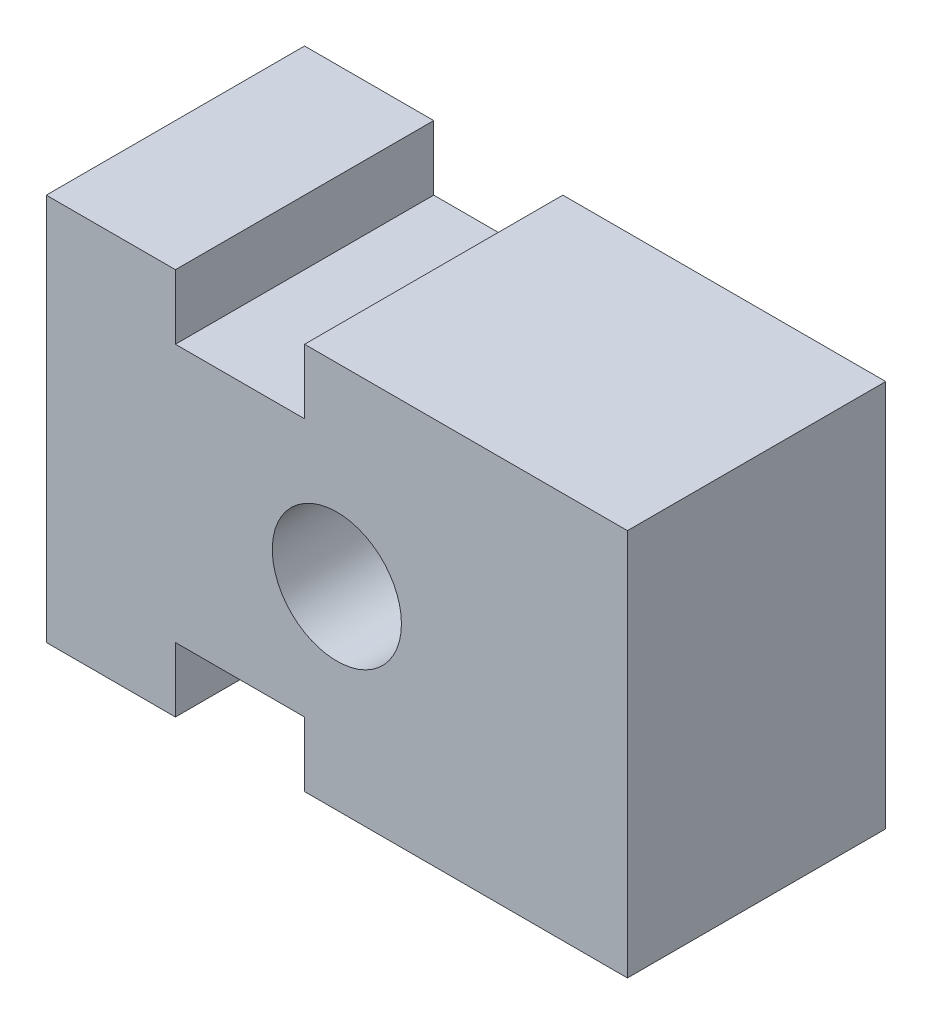
ISO-10303-21;
HEADER;
FILE_DESCRIPTION(('STEP AP214'),'2;1');
FILE_NAME('part.step','',(''),(''),'','','');
FILE_SCHEMA(('AUTOMOTIVE_DESIGN { 1 0 10303 214 1 1 1 1 }'));
ENDSEC;
DATA;
#1=APPLICATION_CONTEXT('core data for automotive mechanical design processes');
#2=APPLICATION_PROTOCOL_DEFINITION('international standard','automotive_design',2000,#1);
#3=PRODUCT_CONTEXT('',#1,'mechanical');
#4=PRODUCT('Part','Part','',(#3));
#5=PRODUCT_RELATED_PRODUCT_CATEGORY('part','',(#4));
#6=PRODUCT_DEFINITION_FORMATION('','',#4);
#7=PRODUCT_DEFINITION_CONTEXT('part definition',#1,'design');
#8=PRODUCT_DEFINITION('design','',#6,#7);
#9=PRODUCT_DEFINITION_SHAPE('','',#8);
#10=(LENGTH_UNIT() NAMED_UNIT(*) SI_UNIT(.MILLI.,.METRE.));
#11=(NAMED_UNIT(*) PLANE_ANGLE_UNIT() SI_UNIT($,.RADIAN.));
#12=(NAMED_UNIT(*) SI_UNIT($,.STERADIAN.) SOLID_ANGLE_UNIT());
#13=UNCERTAINTY_MEASURE_WITH_UNIT(LENGTH_MEASURE(1.E-05),#10,'distance_accuracy_value','');
#14=(GEOMETRIC_REPRESENTATION_CONTEXT(3) GLOBAL_UNCERTAINTY_ASSIGNED_CONTEXT((#13)) GLOBAL_UNIT_ASSIGNED_CONTEXT((#10,
#11,#12)) REPRESENTATION_CONTEXT('',''));
#15=CARTESIAN_POINT('',(0.,0.,0.));
#16=DIRECTION('',(0.,0.,1.));
#17=DIRECTION('',(1.,0.,0.));
#18=AXIS2_PLACEMENT_3D('',#15,#16,#17);
#19=CARTESIAN_POINT('',(25.4,76.2,50.8));
#20=DIRECTION('',(0.,-1.,0.));
#21=DIRECTION('',(1.,0.,0.));
#22=AXIS2_PLACEMENT_3D('',#19,#20,#21);
#23=PLANE('',#22);
#24=DIRECTION('',(-1.,0.,0.));
#25=VECTOR('',#24,1.);
#26=CARTESIAN_POINT('',(25.4,76.2,0.));
#27=LINE('',#26,#25);
#28=CARTESIAN_POINT('',(25.4,76.2,0.));
#29=VERTEX_POINT('',#28);
#30=CARTESIAN_POINT('',(0.,76.2,0.));
#31=VERTEX_POINT('',#30);
#32=EDGE_CURVE('E163',#29,#31,#27,.T.);
#33=ORIENTED_EDGE('',*,*,#32,.T.);
#34=DIRECTION('',(0.,0.,-1.));
#35=VECTOR('',#34,1.);
#36=CARTESIAN_POINT('',(0.,76.2,50.8));
#37=LINE('',#36,#35);
#38=CARTESIAN_POINT('',(0.,76.2,50.8));
#39=VERTEX_POINT('',#38);
#40=EDGE_CURVE('E11',#39,#31,#37,.T.);
#41=ORIENTED_EDGE('',*,*,#40,.F.);
#42=DIRECTION('',(-1.,0.,0.));
#43=VECTOR('',#42,1.);
#44=CARTESIAN_POINT('',(25.4,76.2,50.8));
#45=LINE('',#44,#43);
#46=CARTESIAN_POINT('',(25.4,76.2,50.8));
#47=VERTEX_POINT('',#46);
#48=EDGE_CURVE('E186',#47,#39,#45,.T.);
#49=ORIENTED_EDGE('',*,*,#48,.F.);
#50=DIRECTION('',(0.,0.,-1.));
#51=VECTOR('',#50,1.);
#52=CARTESIAN_POINT('',(25.4,76.2,50.8));
#53=LINE('',#52,#51);
#54=EDGE_CURVE('E159',#47,#29,#53,.T.);
#55=ORIENTED_EDGE('',*,*,#54,.T.);
#56=EDGE_LOOP('',(#33,#41,#49,#55));
#57=FACE_BOUND('',#56,.T.);
#58=ADVANCED_FACE('F43',(#57),#23,.F.);
#59=CARTESIAN_POINT('',(0.,76.2,50.8));
#60=DIRECTION('',(1.,0.,0.));
#61=DIRECTION('',(0.,0.,-1.));
#62=AXIS2_PLACEMENT_3D('',#59,#60,#61);
#63=PLANE('',#62);
#64=DIRECTION('',(0.,-1.,0.));
#65=VECTOR('',#64,1.);
#66=CARTESIAN_POINT('',(0.,76.2,0.));
#67=LINE('',#66,#65);
#68=CARTESIAN_POINT('',(0.,0.,0.));
#69=VERTEX_POINT('',#68);
#70=EDGE_CURVE('E166',#31,#69,#67,.T.);
#71=ORIENTED_EDGE('',*,*,#70,.T.);
#72=DIRECTION('',(0.,0.,-1.));
#73=VECTOR('',#72,1.);
#74=CARTESIAN_POINT('',(0.,0.,50.8));
#75=LINE('',#74,#73);
#76=CARTESIAN_POINT('',(0.,0.,50.8));
#77=VERTEX_POINT('',#76);
#78=EDGE_CURVE('E51',#77,#69,#75,.T.);
#79=ORIENTED_EDGE('',*,*,#78,.F.);
#80=DIRECTION('',(0.,-1.,0.));
#81=VECTOR('',#80,1.);
#82=CARTESIAN_POINT('',(0.,76.2,50.8));
#83=LINE('',#82,#81);
#84=EDGE_CURVE('E114',#39,#77,#83,.T.);
#85=ORIENTED_EDGE('',*,*,#84,.F.);
#86=ORIENTED_EDGE('',*,*,#40,.T.);
#87=EDGE_LOOP('',(#71,#79,#85,#86));
#88=FACE_BOUND('',#87,.T.);
#89=ADVANCED_FACE('F265',(#88),#63,.F.);
#90=CARTESIAN_POINT('',(0.,0.,50.8));
#91=DIRECTION('',(0.,1.,0.));
#92=DIRECTION('',(0.,0.,1.));
#93=AXIS2_PLACEMENT_3D('',#90,#91,#92);
#94=PLANE('',#93);
#95=DIRECTION('',(1.,0.,0.));
#96=VECTOR('',#95,1.);
#97=CARTESIAN_POINT('',(0.,0.,0.));
#98=LINE('',#97,#96);
#99=CARTESIAN_POINT('',(25.4,0.,0.));
#100=VERTEX_POINT('',#99);
#101=EDGE_CURVE('E169',#69,#100,#98,.T.);
#102=ORIENTED_EDGE('',*,*,#101,.T.);
#103=DIRECTION('',(0.,0.,-1.));
#104=VECTOR('',#103,1.);
#105=CARTESIAN_POINT('',(25.4,0.,50.8));
#106=LINE('',#105,#104);
#107=CARTESIAN_POINT('',(25.4,0.,50.8));
#108=VERTEX_POINT('',#107);
#109=EDGE_CURVE('E205',#108,#100,#106,.T.);
#110=ORIENTED_EDGE('',*,*,#109,.F.);
#111=DIRECTION('',(1.,0.,0.));
#112=VECTOR('',#111,1.);
#113=CARTESIAN_POINT('',(0.,0.,50.8));
#114=LINE('',#113,#112);
#115=EDGE_CURVE('E213',#77,#108,#114,.T.);
#116=ORIENTED_EDGE('',*,*,#115,.F.);
#117=ORIENTED_EDGE('',*,*,#78,.T.);
#118=EDGE_LOOP('',(#102,#110,#116,#117));
#119=FACE_BOUND('',#118,.T.);
#120=ADVANCED_FACE('F211',(#119),#94,.F.);
#121=CARTESIAN_POINT('',(25.4,0.,50.8));
#122=DIRECTION('',(-1.,0.,0.));
#123=DIRECTION('',(0.,0.,1.));
#124=AXIS2_PLACEMENT_3D('',#121,#122,#123);
#125=PLANE('',#124);
#126=DIRECTION('',(0.,1.,0.));
#127=VECTOR('',#126,1.);
#128=CARTESIAN_POINT('',(25.4,0.,0.));
#129=LINE('',#128,#127);
#130=CARTESIAN_POINT('',(25.4,12.7,0.));
#131=VERTEX_POINT('',#130);
#132=EDGE_CURVE('E171',#100,#131,#129,.T.);
#133=ORIENTED_EDGE('',*,*,#132,.T.);
#134=DIRECTION('',(0.,0.,-1.));
#135=VECTOR('',#134,1.);
#136=CARTESIAN_POINT('',(25.4,12.7,50.8));
#137=LINE('',#136,#135);
#138=CARTESIAN_POINT('',(25.4,12.7,50.8));
#139=VERTEX_POINT('',#138);
#140=EDGE_CURVE('E202',#139,#131,#137,.T.);
#141=ORIENTED_EDGE('',*,*,#140,.F.);
#142=DIRECTION('',(0.,1.,0.));
#143=VECTOR('',#142,1.);
#144=CARTESIAN_POINT('',(25.4,0.,50.8));
#145=LINE('',#144,#143);
#146=EDGE_CURVE('E231',#108,#139,#145,.T.);
#147=ORIENTED_EDGE('',*,*,#146,.F.);
#148=ORIENTED_EDGE('',*,*,#109,.T.);
#149=EDGE_LOOP('',(#133,#141,#147,#148));
#150=FACE_BOUND('',#149,.T.);
#151=ADVANCED_FACE('F222',(#150),#125,.F.);
#152=CARTESIAN_POINT('',(25.4,12.7,50.8));
#153=DIRECTION('',(0.,1.,0.));
#154=DIRECTION('',(-1.,0.,0.));
#155=AXIS2_PLACEMENT_3D('',#152,#153,#154);
#156=PLANE('',#155);
#157=DIRECTION('',(1.,0.,0.));
#158=VECTOR('',#157,1.);
#159=CARTESIAN_POINT('',(25.4,12.7,0.));
#160=LINE('',#159,#158);
#161=CARTESIAN_POINT('',(50.8,12.7,0.));
#162=VERTEX_POINT('',#161);
#163=EDGE_CURVE('E173',#131,#162,#160,.T.);
#164=ORIENTED_EDGE('',*,*,#163,.T.);
#165=DIRECTION('',(0.,0.,-1.));
#166=VECTOR('',#165,1.);
#167=CARTESIAN_POINT('',(50.8,12.7,50.8));
#168=LINE('',#167,#166);
#169=CARTESIAN_POINT('',(50.8,12.7,50.8));
#170=VERTEX_POINT('',#169);
#171=EDGE_CURVE('E199',#170,#162,#168,.T.);
#172=ORIENTED_EDGE('',*,*,#171,.F.);
#173=DIRECTION('',(1.,0.,0.));
#174=VECTOR('',#173,1.);
#175=CARTESIAN_POINT('',(25.4,12.7,50.8));
#176=LINE('',#175,#174);
#177=EDGE_CURVE('E228',#139,#170,#176,.T.);
#178=ORIENTED_EDGE('',*,*,#177,.F.);
#179=ORIENTED_EDGE('',*,*,#140,.T.);
#180=EDGE_LOOP('',(#164,#172,#178,#179));
#181=FACE_BOUND('',#180,.T.);
#182=ADVANCED_FACE('F226',(#181),#156,.F.);
#183=CARTESIAN_POINT('',(50.8,12.7,50.8));
#184=DIRECTION('',(1.,0.,0.));
#185=DIRECTION('',(0.,1.,0.));
#186=AXIS2_PLACEMENT_3D('',#183,#184,#185);
#187=PLANE('',#186);
#188=DIRECTION('',(0.,-1.,0.));
#189=VECTOR('',#188,1.);
#190=CARTESIAN_POINT('',(50.8,12.7,0.));
#191=LINE('',#190,#189);
#192=CARTESIAN_POINT('',(50.8,0.,0.));
#193=VERTEX_POINT('',#192);
#194=EDGE_CURVE('E175',#162,#193,#191,.T.);
#195=ORIENTED_EDGE('',*,*,#194,.T.);
#196=DIRECTION('',(0.,0.,-1.));
#197=VECTOR('',#196,1.);
#198=CARTESIAN_POINT('',(50.8,0.,50.8));
#199=LINE('',#198,#197);
#200=CARTESIAN_POINT('',(50.8,0.,50.8));
#201=VERTEX_POINT('',#200);
#202=EDGE_CURVE('E196',#201,#193,#199,.T.);
#203=ORIENTED_EDGE('',*,*,#202,.F.);
#204=DIRECTION('',(0.,-1.,0.));
#205=VECTOR('',#204,1.);
#206=CARTESIAN_POINT('',(50.8,12.7,50.8));
#207=LINE('',#206,#205);
#208=EDGE_CURVE('E230',#170,#201,#207,.T.);
#209=ORIENTED_EDGE('',*,*,#208,.F.);
#210=ORIENTED_EDGE('',*,*,#171,.T.);
#211=EDGE_LOOP('',(#195,#203,#209,#210));
#212=FACE_BOUND('',#211,.T.);
#213=ADVANCED_FACE('F278',(#212),#187,.F.);
#214=CARTESIAN_POINT('',(50.8,0.,50.8));
#215=DIRECTION('',(0.,1.,0.));
#216=DIRECTION('',(0.,0.,1.));
#217=AXIS2_PLACEMENT_3D('',#214,#215,#216);
#218=PLANE('',#217);
#219=DIRECTION('',(1.,0.,0.));
#220=VECTOR('',#219,1.);
#221=CARTESIAN_POINT('',(50.8,0.,0.));
#222=LINE('',#221,#220);
#223=CARTESIAN_POINT('',(114.3,0.,0.));
#224=VERTEX_POINT('',#223);
#225=EDGE_CURVE('E177',#193,#224,#222,.T.);
#226=ORIENTED_EDGE('',*,*,#225,.T.);
#227=DIRECTION('',(0.,0.,-1.));
#228=VECTOR('',#227,1.);
#229=CARTESIAN_POINT('',(114.3,0.,50.8));
#230=LINE('',#229,#228);
#231=CARTESIAN_POINT('',(114.3,0.,50.8));
#232=VERTEX_POINT('',#231);
#233=EDGE_CURVE('E193',#232,#224,#230,.T.);
#234=ORIENTED_EDGE('',*,*,#233,.F.);
#235=DIRECTION('',(1.,0.,0.));
#236=VECTOR('',#235,1.);
#237=CARTESIAN_POINT('',(50.8,0.,50.8));
#238=LINE('',#237,#236);
#239=EDGE_CURVE('E233',#201,#232,#238,.T.);
#240=ORIENTED_EDGE('',*,*,#239,.F.);
#241=ORIENTED_EDGE('',*,*,#202,.T.);
#242=EDGE_LOOP('',(#226,#234,#240,#241));
#243=FACE_BOUND('',#242,.T.);
#244=ADVANCED_FACE('F281',(#243),#218,.F.);
#245=CARTESIAN_POINT('',(114.3,0.,50.8));
#246=DIRECTION('',(-1.,0.,0.));
#247=DIRECTION('',(0.,0.,1.));
#248=AXIS2_PLACEMENT_3D('',#245,#246,#247);
#249=PLANE('',#248);
#250=DIRECTION('',(0.,1.,0.));
#251=VECTOR('',#250,1.);
#252=CARTESIAN_POINT('',(114.3,0.,0.));
#253=LINE('',#252,#251);
#254=CARTESIAN_POINT('',(114.3,76.2,0.));
#255=VERTEX_POINT('',#254);
#256=EDGE_CURVE('E179',#224,#255,#253,.T.);
#257=ORIENTED_EDGE('',*,*,#256,.T.);
#258=DIRECTION('',(0.,0.,-1.));
#259=VECTOR('',#258,1.);
#260=CARTESIAN_POINT('',(114.3,76.2,50.8));
#261=LINE('',#260,#259);
#262=CARTESIAN_POINT('',(114.3,76.2,50.8));
#263=VERTEX_POINT('',#262);
#264=EDGE_CURVE('E190',#263,#255,#261,.T.);
#265=ORIENTED_EDGE('',*,*,#264,.F.);
#266=DIRECTION('',(0.,1.,0.));
#267=VECTOR('',#266,1.);
#268=CARTESIAN_POINT('',(114.3,0.,50.8));
#269=LINE('',#268,#267);
#270=EDGE_CURVE('E239',#232,#263,#269,.T.);
#271=ORIENTED_EDGE('',*,*,#270,.F.);
#272=ORIENTED_EDGE('',*,*,#233,.T.);
#273=EDGE_LOOP('',(#257,#265,#271,#272));
#274=FACE_BOUND('',#273,.T.);
#275=ADVANCED_FACE('F245',(#274),#249,.F.);
#276=CARTESIAN_POINT('',(114.3,76.2,50.8));
#277=DIRECTION('',(0.,-1.,0.));
#278=DIRECTION('',(0.,0.,-1.));
#279=AXIS2_PLACEMENT_3D('',#276,#277,#278);
#280=PLANE('',#279);
#281=DIRECTION('',(-1.,0.,0.));
#282=VECTOR('',#281,1.);
#283=CARTESIAN_POINT('',(114.3,76.2,0.));
#284=LINE('',#283,#282);
#285=CARTESIAN_POINT('',(50.8,76.2,0.));
#286=VERTEX_POINT('',#285);
#287=EDGE_CURVE('E181',#255,#286,#284,.T.);
#288=ORIENTED_EDGE('',*,*,#287,.T.);
#289=DIRECTION('',(0.,0.,-1.));
#290=VECTOR('',#289,1.);
#291=CARTESIAN_POINT('',(50.8,76.2,50.8));
#292=LINE('',#291,#290);
#293=CARTESIAN_POINT('',(50.8,76.2,50.8));
#294=VERTEX_POINT('',#293);
#295=EDGE_CURVE('E154',#294,#286,#292,.T.);
#296=ORIENTED_EDGE('',*,*,#295,.F.);
#297=DIRECTION('',(-1.,0.,0.));
#298=VECTOR('',#297,1.);
#299=CARTESIAN_POINT('',(114.3,76.2,50.8));
#300=LINE('',#299,#298);
#301=EDGE_CURVE('E145',#263,#294,#300,.T.);
#302=ORIENTED_EDGE('',*,*,#301,.F.);
#303=ORIENTED_EDGE('',*,*,#264,.T.);
#304=EDGE_LOOP('',(#288,#296,#302,#303));
#305=FACE_BOUND('',#304,.T.);
#306=ADVANCED_FACE('F249',(#305),#280,.F.);
#307=CARTESIAN_POINT('',(50.8,76.2,50.8));
#308=DIRECTION('',(1.,0.,0.));
#309=DIRECTION('',(0.,0.,-1.));
#310=AXIS2_PLACEMENT_3D('',#307,#308,#309);
#311=PLANE('',#310);
#312=DIRECTION('',(0.,-1.,0.));
#313=VECTOR('',#312,1.);
#314=CARTESIAN_POINT('',(50.8,76.2,0.));
#315=LINE('',#314,#313);
#316=CARTESIAN_POINT('',(50.8,63.5,0.));
#317=VERTEX_POINT('',#316);
#318=EDGE_CURVE('E153',#286,#317,#315,.T.);
#319=ORIENTED_EDGE('',*,*,#318,.T.);
#320=DIRECTION('',(0.,0.,-1.));
#321=VECTOR('',#320,1.);
#322=CARTESIAN_POINT('',(50.8,63.5,50.8));
#323=LINE('',#322,#321);
#324=CARTESIAN_POINT('',(50.8,63.5,50.8));
#325=VERTEX_POINT('',#324);
#326=EDGE_CURVE('E150',#325,#317,#323,.T.);
#327=ORIENTED_EDGE('',*,*,#326,.F.);
#328=DIRECTION('',(0.,-1.,0.));
#329=VECTOR('',#328,1.);
#330=CARTESIAN_POINT('',(50.8,76.2,50.8));
#331=LINE('',#330,#329);
#332=EDGE_CURVE('E139',#294,#325,#331,.T.);
#333=ORIENTED_EDGE('',*,*,#332,.F.);
#334=ORIENTED_EDGE('',*,*,#295,.T.);
#335=EDGE_LOOP('',(#319,#327,#333,#334));
#336=FACE_BOUND('',#335,.T.);
#337=ADVANCED_FACE('F151',(#336),#311,.F.);
#338=CARTESIAN_POINT('',(50.8,63.5,50.8));
#339=DIRECTION('',(0.,-1.,0.));
#340=DIRECTION('',(0.,0.,-1.));
#341=AXIS2_PLACEMENT_3D('',#338,#339,#340);
#342=PLANE('',#341);
#343=DIRECTION('',(-1.,0.,0.));
#344=VECTOR('',#343,1.);
#345=CARTESIAN_POINT('',(50.8,63.5,0.));
#346=LINE('',#345,#344);
#347=CARTESIAN_POINT('',(25.4,63.5,0.));
#348=VERTEX_POINT('',#347);
#349=EDGE_CURVE('E100',#317,#348,#346,.T.);
#350=ORIENTED_EDGE('',*,*,#349,.T.);
#351=DIRECTION('',(0.,0.,-1.));
#352=VECTOR('',#351,1.);
#353=CARTESIAN_POINT('',(25.4,63.5,50.8));
#354=LINE('',#353,#352);
#355=CARTESIAN_POINT('',(25.4,63.5,50.8));
#356=VERTEX_POINT('',#355);
#357=EDGE_CURVE('E155',#356,#348,#354,.T.);
#358=ORIENTED_EDGE('',*,*,#357,.F.);
#359=DIRECTION('',(-1.,0.,0.));
#360=VECTOR('',#359,1.);
#361=CARTESIAN_POINT('',(50.8,63.5,50.8));
#362=LINE('',#361,#360);
#363=EDGE_CURVE('E143',#325,#356,#362,.T.);
#364=ORIENTED_EDGE('',*,*,#363,.F.);
#365=ORIENTED_EDGE('',*,*,#326,.T.);
#366=EDGE_LOOP('',(#350,#358,#364,#365));
#367=FACE_BOUND('',#366,.T.);
#368=ADVANCED_FACE('F157',(#367),#342,.F.);
#369=CARTESIAN_POINT('',(25.4,63.5,50.8));
#370=DIRECTION('',(-1.,0.,0.));
#371=DIRECTION('',(0.,0.,1.));
#372=AXIS2_PLACEMENT_3D('',#369,#370,#371);
#373=PLANE('',#372);
#374=DIRECTION('',(0.,1.,0.));
#375=VECTOR('',#374,1.);
#376=CARTESIAN_POINT('',(25.4,63.5,0.));
#377=LINE('',#376,#375);
#378=EDGE_CURVE('E106',#348,#29,#377,.T.);
#379=ORIENTED_EDGE('',*,*,#378,.T.);
#380=ORIENTED_EDGE('',*,*,#54,.F.);
#381=DIRECTION('',(0.,1.,0.));
#382=VECTOR('',#381,1.);
#383=CARTESIAN_POINT('',(25.4,63.5,50.8));
#384=LINE('',#383,#382);
#385=EDGE_CURVE('E59',#356,#47,#384,.T.);
#386=ORIENTED_EDGE('',*,*,#385,.F.);
#387=ORIENTED_EDGE('',*,*,#357,.T.);
#388=EDGE_LOOP('',(#379,#380,#386,#387));
#389=FACE_BOUND('',#388,.T.);
#390=ADVANCED_FACE('F253',(#389),#373,.F.);
#391=CARTESIAN_POINT('',(0.,0.,50.8));
#392=DIRECTION('',(0.,0.,1.));
#393=DIRECTION('',(1.,0.,0.));
#394=AXIS2_PLACEMENT_3D('',#391,#392,#393);
#395=PLANE('',#394);
#396=CARTESIAN_POINT('',(57.15,38.1,50.8));
#397=DIRECTION('',(0.,0.,1.));
#398=DIRECTION('',(1.,0.,0.));
#399=AXIS2_PLACEMENT_3D('',#396,#397,#398);
#400=CIRCLE('',#399,12.7);
#401=CARTESIAN_POINT('',(69.85,38.1,50.8));
#402=VERTEX_POINT('',#401);
#403=EDGE_CURVE('E337',#402,#402,#400,.T.);
#404=ORIENTED_EDGE('',*,*,#403,.F.);
#405=EDGE_LOOP('',(#404));
#406=FACE_BOUND('',#405,.T.);
#407=ORIENTED_EDGE('',*,*,#48,.T.);
#408=ORIENTED_EDGE('',*,*,#84,.T.);
#409=ORIENTED_EDGE('',*,*,#115,.T.);
#410=ORIENTED_EDGE('',*,*,#146,.T.);
#411=ORIENTED_EDGE('',*,*,#177,.T.);
#412=ORIENTED_EDGE('',*,*,#208,.T.);
#413=ORIENTED_EDGE('',*,*,#239,.T.);
#414=ORIENTED_EDGE('',*,*,#270,.T.);
#415=ORIENTED_EDGE('',*,*,#301,.T.);
#416=ORIENTED_EDGE('',*,*,#332,.T.);
#417=ORIENTED_EDGE('',*,*,#363,.T.);
#418=ORIENTED_EDGE('',*,*,#385,.T.);
#419=EDGE_LOOP('',(#407,#408,#409,#410,#411,#412,#413,#414,#415,#416,#417,#418));
#420=FACE_BOUND('',#419,.T.);
#421=ADVANCED_FACE('F141',(#406,#420),#395,.T.);
#422=CARTESIAN_POINT('',(0.,0.,0.));
#423=DIRECTION('',(0.,0.,1.));
#424=DIRECTION('',(1.,0.,0.));
#425=AXIS2_PLACEMENT_3D('',#422,#423,#424);
#426=PLANE('',#425);
#427=CARTESIAN_POINT('',(57.15,38.1,0.));
#428=DIRECTION('',(0.,0.,1.));
#429=DIRECTION('',(1.,0.,0.));
#430=AXIS2_PLACEMENT_3D('',#427,#428,#429);
#431=CIRCLE('',#430,12.7);
#432=CARTESIAN_POINT('',(69.85,38.1,0.));
#433=VERTEX_POINT('',#432);
#434=EDGE_CURVE('E167',#433,#433,#431,.T.);
#435=ORIENTED_EDGE('',*,*,#434,.T.);
#436=EDGE_LOOP('',(#435));
#437=FACE_BOUND('',#436,.T.);
#438=ORIENTED_EDGE('',*,*,#32,.F.);
#439=ORIENTED_EDGE('',*,*,#378,.F.);
#440=ORIENTED_EDGE('',*,*,#349,.F.);
#441=ORIENTED_EDGE('',*,*,#318,.F.);
#442=ORIENTED_EDGE('',*,*,#287,.F.);
#443=ORIENTED_EDGE('',*,*,#256,.F.);
#444=ORIENTED_EDGE('',*,*,#225,.F.);
#445=ORIENTED_EDGE('',*,*,#194,.F.);
#446=ORIENTED_EDGE('',*,*,#163,.F.);
#447=ORIENTED_EDGE('',*,*,#132,.F.);
#448=ORIENTED_EDGE('',*,*,#101,.F.);
#449=ORIENTED_EDGE('',*,*,#70,.F.);
#450=EDGE_LOOP('',(#438,#439,#440,#441,#442,#443,#444,#445,#446,#447,#448,#449));
#451=FACE_BOUND('',#450,.T.);
#452=ADVANCED_FACE('F217',(#437,#451),#426,.F.);
#453=CARTESIAN_POINT('',(57.15,38.1,0.));
#454=DIRECTION('',(0.,0.,1.));
#455=DIRECTION('',(1.,0.,0.));
#456=AXIS2_PLACEMENT_3D('',#453,#454,#455);
#457=CYLINDRICAL_SURFACE('',#456,12.7);
#458=ORIENTED_EDGE('',*,*,#434,.F.);
#459=EDGE_LOOP('',(#458));
#460=FACE_BOUND('',#459,.T.);
#461=ORIENTED_EDGE('',*,*,#403,.T.);
#462=EDGE_LOOP('',(#461));
#463=FACE_BOUND('',#462,.T.);
#464=ADVANCED_FACE('F320',(#460,#463),#457,.F.);
#465=CLOSED_SHELL('',(#58,#89,#120,#151,#182,#213,#244,#275,#306,#337,#368,#390,#421,#452,#464));
#466=MANIFOLD_SOLID_BREP('B2',#465);
#467=ADVANCED_BREP_SHAPE_REPRESENTATION('',(#18,#466),#14);
#468=SHAPE_DEFINITION_REPRESENTATION(#9,#467);
ENDSEC;
END-ISO-10303-21;
